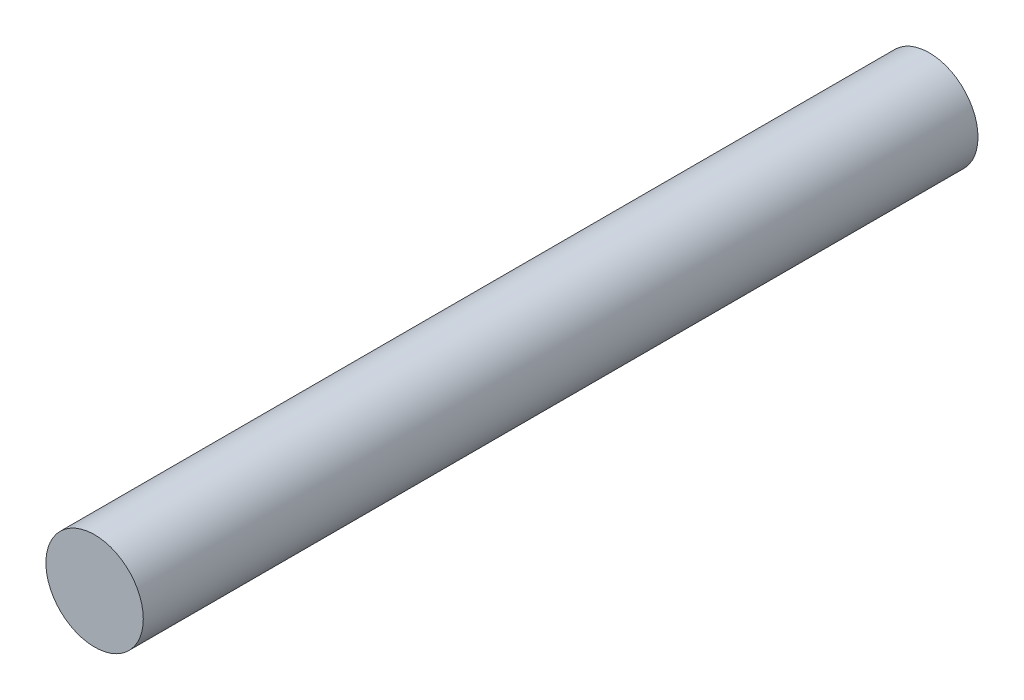
ISO-10303-21;
HEADER;
FILE_DESCRIPTION(('STEP AP214'),'2;1');
FILE_NAME('part.step','',(''),(''),'','','');
FILE_SCHEMA(('AUTOMOTIVE_DESIGN { 1 0 10303 214 1 1 1 1 }'));
ENDSEC;
DATA;
#1=APPLICATION_CONTEXT('core data for automotive mechanical design processes');
#2=APPLICATION_PROTOCOL_DEFINITION('international standard','automotive_design',2000,#1);
#3=PRODUCT_CONTEXT('',#1,'mechanical');
#4=PRODUCT('Part','Part','',(#3));
#5=PRODUCT_RELATED_PRODUCT_CATEGORY('part','',(#4));
#6=PRODUCT_DEFINITION_FORMATION('','',#4);
#7=PRODUCT_DEFINITION_CONTEXT('part definition',#1,'design');
#8=PRODUCT_DEFINITION('design','',#6,#7);
#9=PRODUCT_DEFINITION_SHAPE('','',#8);
#10=(LENGTH_UNIT() NAMED_UNIT(*) SI_UNIT(.MILLI.,.METRE.));
#11=(NAMED_UNIT(*) PLANE_ANGLE_UNIT() SI_UNIT($,.RADIAN.));
#12=(NAMED_UNIT(*) SI_UNIT($,.STERADIAN.) SOLID_ANGLE_UNIT());
#13=UNCERTAINTY_MEASURE_WITH_UNIT(LENGTH_MEASURE(1.E-05),#10,'distance_accuracy_value','');
#14=(GEOMETRIC_REPRESENTATION_CONTEXT(3) GLOBAL_UNCERTAINTY_ASSIGNED_CONTEXT((#13)) GLOBAL_UNIT_ASSIGNED_CONTEXT((#10,
#11,#12)) REPRESENTATION_CONTEXT('',''));
#15=CARTESIAN_POINT('',(0.,0.,0.));
#16=DIRECTION('',(0.,0.,1.));
#17=DIRECTION('',(1.,0.,0.));
#18=AXIS2_PLACEMENT_3D('',#15,#16,#17);
#19=CARTESIAN_POINT('',(0.,0.,30.));
#20=DIRECTION('',(0.,0.,-1.));
#21=DIRECTION('',(-1.,0.,0.));
#22=AXIS2_PLACEMENT_3D('',#19,#20,#21);
#23=CYLINDRICAL_SURFACE('',#22,1.75);
#24=CARTESIAN_POINT('',(0.,0.,30.));
#25=DIRECTION('',(0.,0.,1.));
#26=DIRECTION('',(1.,0.,0.));
#27=AXIS2_PLACEMENT_3D('',#24,#25,#26);
#28=CIRCLE('',#27,1.75);
#29=CARTESIAN_POINT('',(1.75,0.,30.));
#30=VERTEX_POINT('',#29);
#31=EDGE_CURVE('E10',#30,#30,#28,.T.);
#32=ORIENTED_EDGE('',*,*,#31,.F.);
#33=EDGE_LOOP('',(#32));
#34=FACE_BOUND('',#33,.T.);
#35=CARTESIAN_POINT('',(0.,0.,0.));
#36=DIRECTION('',(0.,0.,1.));
#37=DIRECTION('',(1.,0.,0.));
#38=AXIS2_PLACEMENT_3D('',#35,#36,#37);
#39=CIRCLE('',#38,1.75);
#40=CARTESIAN_POINT('',(1.75,0.,0.));
#41=VERTEX_POINT('',#40);
#42=EDGE_CURVE('E46',#41,#41,#39,.T.);
#43=ORIENTED_EDGE('',*,*,#42,.T.);
#44=EDGE_LOOP('',(#43));
#45=FACE_BOUND('',#44,.T.);
#46=ADVANCED_FACE('F43',(#34,#45),#23,.T.);
#47=CARTESIAN_POINT('',(0.,0.,30.));
#48=DIRECTION('',(0.,0.,1.));
#49=DIRECTION('',(1.,0.,0.));
#50=AXIS2_PLACEMENT_3D('',#47,#48,#49);
#51=PLANE('',#50);
#52=ORIENTED_EDGE('',*,*,#31,.T.);
#53=EDGE_LOOP('',(#52));
#54=FACE_BOUND('',#53,.T.);
#55=ADVANCED_FACE('F60',(#54),#51,.T.);
#56=CARTESIAN_POINT('',(0.,0.,0.));
#57=DIRECTION('',(0.,0.,1.));
#58=DIRECTION('',(1.,0.,0.));
#59=AXIS2_PLACEMENT_3D('',#56,#57,#58);
#60=PLANE('',#59);
#61=ORIENTED_EDGE('',*,*,#42,.F.);
#62=EDGE_LOOP('',(#61));
#63=FACE_BOUND('',#62,.T.);
#64=ADVANCED_FACE('F58',(#63),#60,.F.);
#65=CLOSED_SHELL('',(#46,#55,#64));
#66=MANIFOLD_SOLID_BREP('B2',#65);
#67=ADVANCED_BREP_SHAPE_REPRESENTATION('',(#18,#66),#14);
#68=SHAPE_DEFINITION_REPRESENTATION(#9,#67);
ENDSEC;
END-ISO-10303-21;
